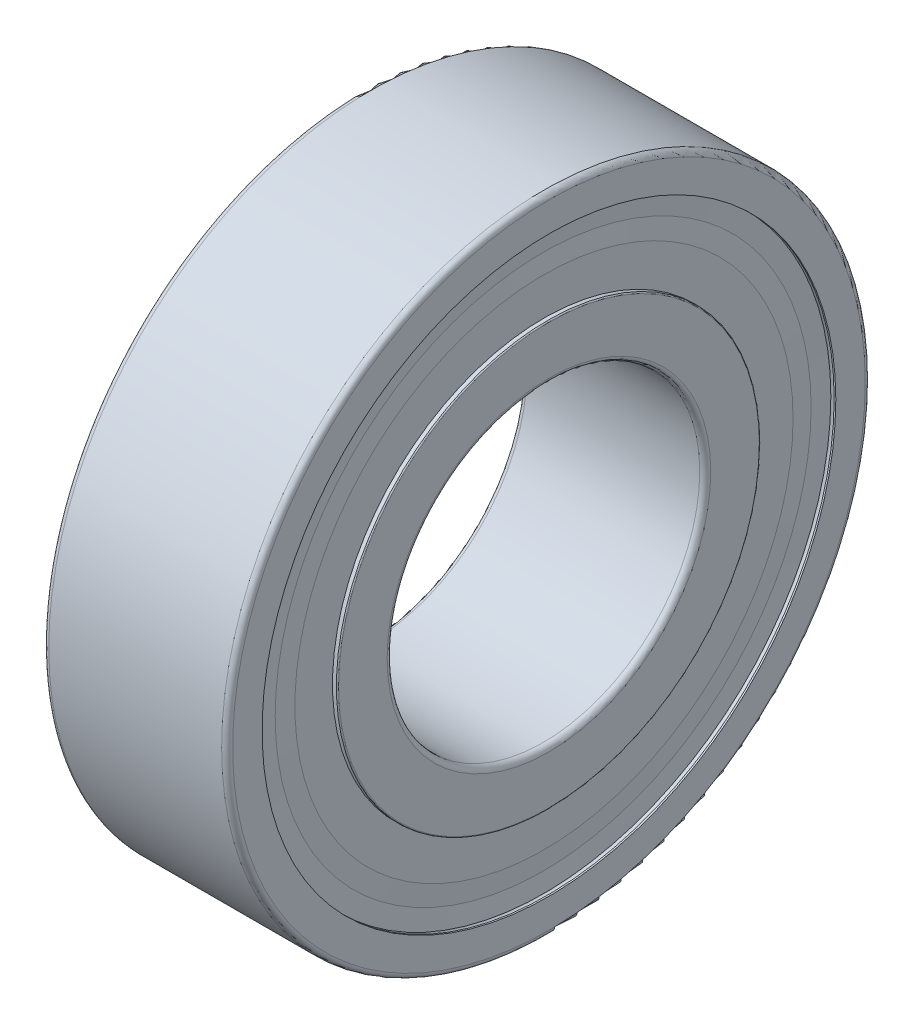
ISO-10303-21;
HEADER;
FILE_DESCRIPTION(('STEP AP214'),'2;1');
FILE_NAME('part.step','',(''),(''),'','','');
FILE_SCHEMA(('AUTOMOTIVE_DESIGN { 1 0 10303 214 1 1 1 1 }'));
ENDSEC;
DATA;
#1=APPLICATION_CONTEXT('core data for automotive mechanical design processes');
#2=APPLICATION_PROTOCOL_DEFINITION('international standard','automotive_design',2000,#1);
#3=PRODUCT_CONTEXT('',#1,'mechanical');
#4=PRODUCT('Part','Part','',(#3));
#5=PRODUCT_RELATED_PRODUCT_CATEGORY('part','',(#4));
#6=PRODUCT_DEFINITION_FORMATION('','',#4);
#7=PRODUCT_DEFINITION_CONTEXT('part definition',#1,'design');
#8=PRODUCT_DEFINITION('design','',#6,#7);
#9=PRODUCT_DEFINITION_SHAPE('','',#8);
#10=(LENGTH_UNIT() NAMED_UNIT(*) SI_UNIT(.MILLI.,.METRE.));
#11=(NAMED_UNIT(*) PLANE_ANGLE_UNIT() SI_UNIT($,.RADIAN.));
#12=(NAMED_UNIT(*) SI_UNIT($,.STERADIAN.) SOLID_ANGLE_UNIT());
#13=UNCERTAINTY_MEASURE_WITH_UNIT(LENGTH_MEASURE(1.E-05),#10,'distance_accuracy_value','');
#14=(GEOMETRIC_REPRESENTATION_CONTEXT(3) GLOBAL_UNCERTAINTY_ASSIGNED_CONTEXT((#13)) GLOBAL_UNIT_ASSIGNED_CONTEXT((#10,
#11,#12)) REPRESENTATION_CONTEXT('',''));
#15=CARTESIAN_POINT('',(0.,0.,0.));
#16=DIRECTION('',(0.,0.,1.));
#17=DIRECTION('',(1.,0.,0.));
#18=AXIS2_PLACEMENT_3D('',#15,#16,#17);
#19=CARTESIAN_POINT('',(50.,0.,0.));
#20=DIRECTION('',(1.,0.,0.));
#21=DIRECTION('',(0.,0.,-1.));
#22=AXIS2_PLACEMENT_3D('',#19,#20,#21);
#23=CYLINDRICAL_SURFACE('',#22,15.6);
#24=CARTESIAN_POINT('',(9.73,0.,0.));
#25=DIRECTION('',(1.,0.,0.));
#26=DIRECTION('',(0.,0.,-1.));
#27=AXIS2_PLACEMENT_3D('',#24,#25,#26);
#28=CIRCLE('',#27,15.6);
#29=CARTESIAN_POINT('',(9.73,0.,-15.6));
#30=VERTEX_POINT('',#29);
#31=EDGE_CURVE('P0_E11',#30,#30,#28,.T.);
#32=ORIENTED_EDGE('',*,*,#31,.F.);
#33=EDGE_LOOP('',(#32));
#34=FACE_BOUND('',#33,.T.);
#35=CARTESIAN_POINT('',(9.64,0.,0.));
#36=DIRECTION('',(1.,0.,0.));
#37=DIRECTION('',(0.,0.,-1.));
#38=AXIS2_PLACEMENT_3D('',#35,#36,#37);
#39=CIRCLE('',#38,15.6);
#40=CARTESIAN_POINT('',(9.64,0.,-15.6));
#41=VERTEX_POINT('',#40);
#42=EDGE_CURVE('P0_E167',#41,#41,#39,.T.);
#43=ORIENTED_EDGE('',*,*,#42,.T.);
#44=EDGE_LOOP('',(#43));
#45=FACE_BOUND('',#44,.T.);
#46=ADVANCED_FACE('P0_F17',(#34,#45),#23,.T.);
#47=CARTESIAN_POINT('',(9.685,0.,0.));
#48=DIRECTION('',(1.,0.,0.));
#49=DIRECTION('',(0.,0.,-1.));
#50=AXIS2_PLACEMENT_3D('',#47,#48,#49);
#51=CONICAL_SURFACE('',#50,14.5725,1.52702867499964);
#52=CARTESIAN_POINT('',(9.685,0.,0.));
#53=DIRECTION('',(1.,0.,0.));
#54=DIRECTION('',(0.,0.,-1.));
#55=AXIS2_PLACEMENT_3D('',#52,#53,#54);
#56=CIRCLE('',#55,14.5725);
#57=CARTESIAN_POINT('',(9.685,0.,-14.5725));
#58=VERTEX_POINT('',#57);
#59=EDGE_CURVE('P0_E27',#58,#58,#56,.T.);
#60=ORIENTED_EDGE('',*,*,#59,.F.);
#61=EDGE_LOOP('',(#60));
#62=FACE_BOUND('',#61,.T.);
#63=ORIENTED_EDGE('',*,*,#31,.T.);
#64=EDGE_LOOP('',(#63));
#65=FACE_BOUND('',#64,.T.);
#66=ADVANCED_FACE('P0_F203',(#62,#65),#51,.F.);
#67=CARTESIAN_POINT('',(9.73,0.,0.));
#68=DIRECTION('',(-1.,0.,0.));
#69=DIRECTION('',(0.,0.,1.));
#70=AXIS2_PLACEMENT_3D('',#67,#68,#69);
#71=CONICAL_SURFACE('',#70,13.545,1.52702867499964);
#72=CARTESIAN_POINT('',(9.73,0.,0.));
#73=DIRECTION('',(1.,0.,0.));
#74=DIRECTION('',(0.,0.,-1.));
#75=AXIS2_PLACEMENT_3D('',#72,#73,#74);
#76=CIRCLE('',#75,13.545);
#77=CARTESIAN_POINT('',(9.73,0.,-13.545));
#78=VERTEX_POINT('',#77);
#79=EDGE_CURVE('P0_E143',#78,#78,#76,.T.);
#80=ORIENTED_EDGE('',*,*,#79,.F.);
#81=EDGE_LOOP('',(#80));
#82=FACE_BOUND('',#81,.T.);
#83=ORIENTED_EDGE('',*,*,#59,.T.);
#84=EDGE_LOOP('',(#83));
#85=FACE_BOUND('',#84,.T.);
#86=ADVANCED_FACE('P0_F200',(#82,#85),#71,.T.);
#87=CARTESIAN_POINT('',(9.73,11.49,0.));
#88=DIRECTION('',(1.,0.,0.));
#89=DIRECTION('',(0.,1.,0.));
#90=AXIS2_PLACEMENT_3D('',#87,#88,#89);
#91=PLANE('',#90);
#92=CARTESIAN_POINT('',(9.73,0.,0.));
#93=DIRECTION('',(-1.,0.,0.));
#94=DIRECTION('',(0.,0.,-1.));
#95=AXIS2_PLACEMENT_3D('',#92,#93,#94);
#96=CIRCLE('',#95,11.5);
#97=CARTESIAN_POINT('',(9.73,0.,-11.5));
#98=VERTEX_POINT('',#97);
#99=EDGE_CURVE('P0_E148',#98,#98,#96,.T.);
#100=ORIENTED_EDGE('',*,*,#99,.T.);
#101=EDGE_LOOP('',(#100));
#102=FACE_BOUND('',#101,.T.);
#103=ORIENTED_EDGE('',*,*,#79,.T.);
#104=EDGE_LOOP('',(#103));
#105=FACE_BOUND('',#104,.T.);
#106=ADVANCED_FACE('P0_F198',(#102,#105),#91,.T.);
#107=CARTESIAN_POINT('',(9.55,0.,0.));
#108=DIRECTION('',(-1.,0.,0.));
#109=DIRECTION('',(0.,0.,1.));
#110=AXIS2_PLACEMENT_3D('',#107,#108,#109);
#111=CONICAL_SURFACE('',#110,13.545,1.52702867499964);
#112=CARTESIAN_POINT('',(9.55,0.,0.));
#113=DIRECTION('',(1.,0.,0.));
#114=DIRECTION('',(0.,0.,-1.));
#115=AXIS2_PLACEMENT_3D('',#112,#113,#114);
#116=CIRCLE('',#115,13.545);
#117=CARTESIAN_POINT('',(9.55,0.,-13.545));
#118=VERTEX_POINT('',#117);
#119=EDGE_CURVE('P0_E170',#118,#118,#116,.T.);
#120=ORIENTED_EDGE('',*,*,#119,.F.);
#121=EDGE_LOOP('',(#120));
#122=FACE_BOUND('',#121,.T.);
#123=CARTESIAN_POINT('',(9.63956204379562,0.,0.));
#124=DIRECTION('',(1.,0.,0.));
#125=DIRECTION('',(0.,0.,1.));
#126=AXIS2_PLACEMENT_3D('',#123,#124,#125);
#127=CIRCLE('',#126,11.5);
#128=CARTESIAN_POINT('',(9.63956204379562,0.,11.5));
#129=VERTEX_POINT('',#128);
#130=EDGE_CURVE('P0_E125',#129,#129,#127,.T.);
#131=ORIENTED_EDGE('',*,*,#130,.T.);
#132=EDGE_LOOP('',(#131));
#133=FACE_BOUND('',#132,.T.);
#134=ADVANCED_FACE('P0_F19',(#122,#133),#111,.F.);
#135=CARTESIAN_POINT('',(9.55,14.5725,0.));
#136=DIRECTION('',(-1.,0.,0.));
#137=DIRECTION('',(0.,0.,1.));
#138=AXIS2_PLACEMENT_3D('',#135,#136,#137);
#139=PLANE('',#138);
#140=CARTESIAN_POINT('',(9.55,0.,0.));
#141=DIRECTION('',(1.,0.,0.));
#142=DIRECTION('',(0.,0.,-1.));
#143=AXIS2_PLACEMENT_3D('',#140,#141,#142);
#144=CIRCLE('',#143,14.5725);
#145=CARTESIAN_POINT('',(9.55,0.,-14.5725));
#146=VERTEX_POINT('',#145);
#147=EDGE_CURVE('P0_E166',#146,#146,#144,.T.);
#148=ORIENTED_EDGE('',*,*,#147,.F.);
#149=EDGE_LOOP('',(#148));
#150=FACE_BOUND('',#149,.T.);
#151=ORIENTED_EDGE('',*,*,#119,.T.);
#152=EDGE_LOOP('',(#151));
#153=FACE_BOUND('',#152,.T.);
#154=ADVANCED_FACE('P0_F244',(#150,#153),#139,.T.);
#155=CARTESIAN_POINT('',(9.64,0.,0.));
#156=DIRECTION('',(1.,0.,0.));
#157=DIRECTION('',(0.,0.,-1.));
#158=AXIS2_PLACEMENT_3D('',#155,#156,#157);
#159=CONICAL_SURFACE('',#158,15.6,1.48342806694239);
#160=ORIENTED_EDGE('',*,*,#42,.F.);
#161=EDGE_LOOP('',(#160));
#162=FACE_BOUND('',#161,.T.);
#163=ORIENTED_EDGE('',*,*,#147,.T.);
#164=EDGE_LOOP('',(#163));
#165=FACE_BOUND('',#164,.T.);
#166=ADVANCED_FACE('P0_F246',(#162,#165),#159,.T.);
#167=CARTESIAN_POINT('',(0.45,0.,0.));
#168=DIRECTION('',(-1.,0.,0.));
#169=DIRECTION('',(0.,0.,1.));
#170=AXIS2_PLACEMENT_3D('',#167,#168,#169);
#171=CONICAL_SURFACE('',#170,14.5725,1.48342806694239);
#172=CARTESIAN_POINT('',(0.45,0.,0.));
#173=DIRECTION('',(1.,0.,0.));
#174=DIRECTION('',(0.,0.,-1.));
#175=AXIS2_PLACEMENT_3D('',#172,#173,#174);
#176=CIRCLE('',#175,14.5725);
#177=CARTESIAN_POINT('',(0.45,0.,-14.5725));
#178=VERTEX_POINT('',#177);
#179=EDGE_CURVE('P0_E163',#178,#178,#176,.T.);
#180=ORIENTED_EDGE('',*,*,#179,.F.);
#181=EDGE_LOOP('',(#180));
#182=FACE_BOUND('',#181,.T.);
#183=CARTESIAN_POINT('',(0.36,0.,0.));
#184=DIRECTION('',(1.,0.,0.));
#185=DIRECTION('',(0.,0.,-1.));
#186=AXIS2_PLACEMENT_3D('',#183,#184,#185);
#187=CIRCLE('',#186,15.6);
#188=CARTESIAN_POINT('',(0.36,0.,-15.6));
#189=VERTEX_POINT('',#188);
#190=EDGE_CURVE('P0_E140',#189,#189,#187,.T.);
#191=ORIENTED_EDGE('',*,*,#190,.T.);
#192=EDGE_LOOP('',(#191));
#193=FACE_BOUND('',#192,.T.);
#194=ADVANCED_FACE('P0_F252',(#182,#193),#171,.T.);
#195=CARTESIAN_POINT('',(0.45,13.545,0.));
#196=DIRECTION('',(1.,0.,0.));
#197=DIRECTION('',(0.,1.,0.));
#198=AXIS2_PLACEMENT_3D('',#195,#196,#197);
#199=PLANE('',#198);
#200=CARTESIAN_POINT('',(0.45,0.,0.));
#201=DIRECTION('',(1.,0.,0.));
#202=DIRECTION('',(0.,0.,-1.));
#203=AXIS2_PLACEMENT_3D('',#200,#201,#202);
#204=CIRCLE('',#203,13.545);
#205=CARTESIAN_POINT('',(0.45,0.,-13.545));
#206=VERTEX_POINT('',#205);
#207=EDGE_CURVE('P0_E156',#206,#206,#204,.T.);
#208=ORIENTED_EDGE('',*,*,#207,.F.);
#209=EDGE_LOOP('',(#208));
#210=FACE_BOUND('',#209,.T.);
#211=ORIENTED_EDGE('',*,*,#179,.T.);
#212=EDGE_LOOP('',(#211));
#213=FACE_BOUND('',#212,.T.);
#214=ADVANCED_FACE('P0_F249',(#210,#213),#199,.T.);
#215=CARTESIAN_POINT('',(0.36,0.,0.));
#216=DIRECTION('',(1.,0.,0.));
#217=DIRECTION('',(0.,0.,-1.));
#218=AXIS2_PLACEMENT_3D('',#215,#216,#217);
#219=CONICAL_SURFACE('',#218,11.49,1.52702867499964);
#220=CARTESIAN_POINT('',(0.360437956204379,0.,0.));
#221=DIRECTION('',(-1.,0.,0.));
#222=DIRECTION('',(0.,0.,-1.));
#223=AXIS2_PLACEMENT_3D('',#220,#221,#222);
#224=CIRCLE('',#223,11.5);
#225=CARTESIAN_POINT('',(0.360437956204379,0.,-11.5));
#226=VERTEX_POINT('',#225);
#227=EDGE_CURVE('P0_E147',#226,#226,#224,.T.);
#228=ORIENTED_EDGE('',*,*,#227,.T.);
#229=EDGE_LOOP('',(#228));
#230=FACE_BOUND('',#229,.T.);
#231=ORIENTED_EDGE('',*,*,#207,.T.);
#232=EDGE_LOOP('',(#231));
#233=FACE_BOUND('',#232,.T.);
#234=ADVANCED_FACE('P0_F231',(#230,#233),#219,.F.);
#235=CARTESIAN_POINT('',(0.27,13.545,0.));
#236=DIRECTION('',(-1.,0.,0.));
#237=DIRECTION('',(0.,0.,1.));
#238=AXIS2_PLACEMENT_3D('',#235,#236,#237);
#239=PLANE('',#238);
#240=CARTESIAN_POINT('',(0.27,0.,0.));
#241=DIRECTION('',(1.,0.,0.));
#242=DIRECTION('',(0.,0.,-1.));
#243=AXIS2_PLACEMENT_3D('',#240,#241,#242);
#244=CIRCLE('',#243,13.545);
#245=CARTESIAN_POINT('',(0.27,0.,-13.545));
#246=VERTEX_POINT('',#245);
#247=EDGE_CURVE('P0_E139',#246,#246,#244,.T.);
#248=ORIENTED_EDGE('',*,*,#247,.F.);
#249=EDGE_LOOP('',(#248));
#250=FACE_BOUND('',#249,.T.);
#251=CARTESIAN_POINT('',(0.27,0.,0.));
#252=DIRECTION('',(1.,0.,0.));
#253=DIRECTION('',(0.,0.,1.));
#254=AXIS2_PLACEMENT_3D('',#251,#252,#253);
#255=CIRCLE('',#254,11.5);
#256=CARTESIAN_POINT('',(0.27,0.,11.5));
#257=VERTEX_POINT('',#256);
#258=EDGE_CURVE('P0_E149',#257,#257,#255,.T.);
#259=ORIENTED_EDGE('',*,*,#258,.T.);
#260=EDGE_LOOP('',(#259));
#261=FACE_BOUND('',#260,.T.);
#262=ADVANCED_FACE('P0_F227',(#250,#261),#239,.T.);
#263=CARTESIAN_POINT('',(0.315,0.,0.));
#264=DIRECTION('',(1.,0.,0.));
#265=DIRECTION('',(0.,0.,-1.));
#266=AXIS2_PLACEMENT_3D('',#263,#264,#265);
#267=CONICAL_SURFACE('',#266,14.5725,1.52702867499964);
#268=CARTESIAN_POINT('',(0.315,0.,0.));
#269=DIRECTION('',(1.,0.,0.));
#270=DIRECTION('',(0.,0.,-1.));
#271=AXIS2_PLACEMENT_3D('',#268,#269,#270);
#272=CIRCLE('',#271,14.5725);
#273=CARTESIAN_POINT('',(0.315,0.,-14.5725));
#274=VERTEX_POINT('',#273);
#275=EDGE_CURVE('P0_E137',#274,#274,#272,.T.);
#276=ORIENTED_EDGE('',*,*,#275,.F.);
#277=EDGE_LOOP('',(#276));
#278=FACE_BOUND('',#277,.T.);
#279=ORIENTED_EDGE('',*,*,#247,.T.);
#280=EDGE_LOOP('',(#279));
#281=FACE_BOUND('',#280,.T.);
#282=ADVANCED_FACE('P0_F230',(#278,#281),#267,.T.);
#283=CARTESIAN_POINT('',(0.27,0.,0.));
#284=DIRECTION('',(-1.,0.,0.));
#285=DIRECTION('',(0.,0.,1.));
#286=AXIS2_PLACEMENT_3D('',#283,#284,#285);
#287=CONICAL_SURFACE('',#286,15.6,1.52702867499964);
#288=CARTESIAN_POINT('',(0.27,0.,0.));
#289=DIRECTION('',(1.,0.,0.));
#290=DIRECTION('',(0.,0.,-1.));
#291=AXIS2_PLACEMENT_3D('',#288,#289,#290);
#292=CIRCLE('',#291,15.6);
#293=CARTESIAN_POINT('',(0.27,0.,-15.6));
#294=VERTEX_POINT('',#293);
#295=EDGE_CURVE('P0_E184',#294,#294,#292,.T.);
#296=ORIENTED_EDGE('',*,*,#295,.F.);
#297=EDGE_LOOP('',(#296));
#298=FACE_BOUND('',#297,.T.);
#299=ORIENTED_EDGE('',*,*,#275,.T.);
#300=EDGE_LOOP('',(#299));
#301=FACE_BOUND('',#300,.T.);
#302=ADVANCED_FACE('P0_F242',(#298,#301),#287,.F.);
#303=CARTESIAN_POINT('',(50.,0.,0.));
#304=DIRECTION('',(1.,0.,0.));
#305=DIRECTION('',(0.,0.,-1.));
#306=AXIS2_PLACEMENT_3D('',#303,#304,#305);
#307=CYLINDRICAL_SURFACE('',#306,15.6);
#308=ORIENTED_EDGE('',*,*,#190,.F.);
#309=EDGE_LOOP('',(#308));
#310=FACE_BOUND('',#309,.T.);
#311=ORIENTED_EDGE('',*,*,#295,.T.);
#312=EDGE_LOOP('',(#311));
#313=FACE_BOUND('',#312,.T.);
#314=ADVANCED_FACE('P0_F271',(#310,#313),#307,.T.);
#315=CARTESIAN_POINT('',(50.,0.,0.));
#316=DIRECTION('',(1.,0.,0.));
#317=DIRECTION('',(0.,0.,-1.));
#318=AXIS2_PLACEMENT_3D('',#315,#316,#317);
#319=CYLINDRICAL_SURFACE('',#318,11.5);
#320=CARTESIAN_POINT('',(3.15090265264373,0.,0.));
#321=DIRECTION('',(1.,0.,0.));
#322=DIRECTION('',(0.,0.,-1.));
#323=AXIS2_PLACEMENT_3D('',#320,#321,#322);
#324=CIRCLE('',#323,11.5);
#325=CARTESIAN_POINT('',(3.15090265264373,0.,-11.5));
#326=VERTEX_POINT('',#325);
#327=EDGE_CURVE('P0_E144',#326,#326,#324,.T.);
#328=ORIENTED_EDGE('',*,*,#327,.F.);
#329=EDGE_LOOP('',(#328));
#330=FACE_BOUND('',#329,.T.);
#331=ORIENTED_EDGE('',*,*,#227,.F.);
#332=EDGE_LOOP('',(#331));
#333=FACE_BOUND('',#332,.T.);
#334=ADVANCED_FACE('P0_F273',(#330,#333),#319,.T.);
#335=CARTESIAN_POINT('',(5.,0.,0.));
#336=DIRECTION('',(1.,0.,0.));
#337=DIRECTION('',(0.,0.,-1.));
#338=AXIS2_PLACEMENT_3D('',#335,#336,#337);
#339=TOROIDAL_SURFACE('',#338,13.,2.381);
#340=ORIENTED_EDGE('',*,*,#327,.T.);
#341=EDGE_LOOP('',(#340));
#342=FACE_BOUND('',#341,.T.);
#343=CARTESIAN_POINT('',(6.84909734735627,0.,0.));
#344=DIRECTION('',(1.,0.,0.));
#345=DIRECTION('',(0.,0.,-1.));
#346=AXIS2_PLACEMENT_3D('',#343,#344,#345);
#347=CIRCLE('',#346,11.5);
#348=CARTESIAN_POINT('',(6.84909734735627,0.,-11.5));
#349=VERTEX_POINT('',#348);
#350=EDGE_CURVE('P0_E121',#349,#349,#347,.T.);
#351=ORIENTED_EDGE('',*,*,#350,.F.);
#352=EDGE_LOOP('',(#351));
#353=FACE_BOUND('',#352,.T.);
#354=ADVANCED_FACE('P0_F269',(#342,#353),#339,.F.);
#355=CARTESIAN_POINT('',(50.,0.,0.));
#356=DIRECTION('',(1.,0.,0.));
#357=DIRECTION('',(0.,0.,-1.));
#358=AXIS2_PLACEMENT_3D('',#355,#356,#357);
#359=CYLINDRICAL_SURFACE('',#358,11.5);
#360=CARTESIAN_POINT('',(9.94,0.,0.));
#361=DIRECTION('',(1.,0.,0.));
#362=DIRECTION('',(0.,0.,-1.));
#363=AXIS2_PLACEMENT_3D('',#360,#361,#362);
#364=CIRCLE('',#363,11.5);
#365=CARTESIAN_POINT('',(9.94,0.,-11.5));
#366=VERTEX_POINT('',#365);
#367=EDGE_CURVE('P0_E174',#366,#366,#364,.T.);
#368=ORIENTED_EDGE('',*,*,#367,.F.);
#369=EDGE_LOOP('',(#368));
#370=FACE_BOUND('',#369,.T.);
#371=ORIENTED_EDGE('',*,*,#99,.F.);
#372=EDGE_LOOP('',(#371));
#373=FACE_BOUND('',#372,.T.);
#374=ADVANCED_FACE('P0_F235',(#370,#373),#359,.T.);
#375=CARTESIAN_POINT('',(9.94,0.,0.));
#376=DIRECTION('',(1.,0.,0.));
#377=DIRECTION('',(0.,0.,-1.));
#378=AXIS2_PLACEMENT_3D('',#375,#376,#377);
#379=TOROIDAL_SURFACE('',#378,11.44,0.0599999999999976);
#380=CARTESIAN_POINT('',(10.,0.,0.));
#381=DIRECTION('',(1.,0.,0.));
#382=DIRECTION('',(0.,0.,-1.));
#383=AXIS2_PLACEMENT_3D('',#380,#381,#382);
#384=CIRCLE('',#383,11.44);
#385=CARTESIAN_POINT('',(10.,0.,-11.44));
#386=VERTEX_POINT('',#385);
#387=EDGE_CURVE('P0_E161',#386,#386,#384,.T.);
#388=ORIENTED_EDGE('',*,*,#387,.F.);
#389=EDGE_LOOP('',(#388));
#390=FACE_BOUND('',#389,.T.);
#391=ORIENTED_EDGE('',*,*,#367,.T.);
#392=EDGE_LOOP('',(#391));
#393=FACE_BOUND('',#392,.T.);
#394=ADVANCED_FACE('P0_F219',(#390,#393),#379,.T.);
#395=CARTESIAN_POINT('',(10.,8.8,0.));
#396=DIRECTION('',(1.,0.,0.));
#397=DIRECTION('',(0.,1.,0.));
#398=AXIS2_PLACEMENT_3D('',#395,#396,#397);
#399=PLANE('',#398);
#400=CARTESIAN_POINT('',(10.,0.,0.));
#401=DIRECTION('',(1.,0.,0.));
#402=DIRECTION('',(0.,0.,-1.));
#403=AXIS2_PLACEMENT_3D('',#400,#401,#402);
#404=CIRCLE('',#403,8.8);
#405=CARTESIAN_POINT('',(10.,0.,-8.8));
#406=VERTEX_POINT('',#405);
#407=EDGE_CURVE('P0_E157',#406,#406,#404,.T.);
#408=ORIENTED_EDGE('',*,*,#407,.F.);
#409=EDGE_LOOP('',(#408));
#410=FACE_BOUND('',#409,.T.);
#411=ORIENTED_EDGE('',*,*,#387,.T.);
#412=EDGE_LOOP('',(#411));
#413=FACE_BOUND('',#412,.T.);
#414=ADVANCED_FACE('P0_F215',(#410,#413),#399,.T.);
#415=CARTESIAN_POINT('',(9.7,0.,0.));
#416=DIRECTION('',(1.,0.,0.));
#417=DIRECTION('',(0.,0.,-1.));
#418=AXIS2_PLACEMENT_3D('',#415,#416,#417);
#419=TOROIDAL_SURFACE('',#418,8.8,0.300000000000005);
#420=CARTESIAN_POINT('',(9.7,0.,0.));
#421=DIRECTION('',(1.,0.,0.));
#422=DIRECTION('',(0.,0.,-1.));
#423=AXIS2_PLACEMENT_3D('',#420,#421,#422);
#424=CIRCLE('',#423,8.5);
#425=CARTESIAN_POINT('',(9.7,0.,-8.5));
#426=VERTEX_POINT('',#425);
#427=EDGE_CURVE('P0_E162',#426,#426,#424,.T.);
#428=ORIENTED_EDGE('',*,*,#427,.F.);
#429=EDGE_LOOP('',(#428));
#430=FACE_BOUND('',#429,.T.);
#431=ORIENTED_EDGE('',*,*,#407,.T.);
#432=EDGE_LOOP('',(#431));
#433=FACE_BOUND('',#432,.T.);
#434=ADVANCED_FACE('P0_F218',(#430,#433),#419,.T.);
#435=CARTESIAN_POINT('',(50.,0.,0.));
#436=DIRECTION('',(1.,0.,0.));
#437=DIRECTION('',(0.,0.,-1.));
#438=AXIS2_PLACEMENT_3D('',#435,#436,#437);
#439=CYLINDRICAL_SURFACE('',#438,8.5);
#440=CARTESIAN_POINT('',(0.3,0.,0.));
#441=DIRECTION('',(1.,0.,0.));
#442=DIRECTION('',(0.,0.,-1.));
#443=AXIS2_PLACEMENT_3D('',#440,#441,#442);
#444=CIRCLE('',#443,8.5);
#445=CARTESIAN_POINT('',(0.3,0.,-8.5));
#446=VERTEX_POINT('',#445);
#447=EDGE_CURVE('P0_E183',#446,#446,#444,.T.);
#448=ORIENTED_EDGE('',*,*,#447,.F.);
#449=EDGE_LOOP('',(#448));
#450=FACE_BOUND('',#449,.T.);
#451=ORIENTED_EDGE('',*,*,#427,.T.);
#452=EDGE_LOOP('',(#451));
#453=FACE_BOUND('',#452,.T.);
#454=ADVANCED_FACE('P0_F225',(#450,#453),#439,.F.);
#455=CARTESIAN_POINT('',(0.3,0.,0.));
#456=DIRECTION('',(1.,0.,0.));
#457=DIRECTION('',(0.,0.,-1.));
#458=AXIS2_PLACEMENT_3D('',#455,#456,#457);
#459=TOROIDAL_SURFACE('',#458,8.8,0.3);
#460=CARTESIAN_POINT('',(0.,0.,0.));
#461=DIRECTION('',(1.,0.,0.));
#462=DIRECTION('',(0.,0.,-1.));
#463=AXIS2_PLACEMENT_3D('',#460,#461,#462);
#464=CIRCLE('',#463,8.8);
#465=CARTESIAN_POINT('',(0.,0.,-8.8));
#466=VERTEX_POINT('',#465);
#467=EDGE_CURVE('P0_E190',#466,#466,#464,.T.);
#468=ORIENTED_EDGE('',*,*,#467,.F.);
#469=EDGE_LOOP('',(#468));
#470=FACE_BOUND('',#469,.T.);
#471=ORIENTED_EDGE('',*,*,#447,.T.);
#472=EDGE_LOOP('',(#471));
#473=FACE_BOUND('',#472,.T.);
#474=ADVANCED_FACE('P0_F221',(#470,#473),#459,.T.);
#475=CARTESIAN_POINT('',(0.,11.44,0.));
#476=DIRECTION('',(-1.,0.,0.));
#477=DIRECTION('',(0.,0.,1.));
#478=AXIS2_PLACEMENT_3D('',#475,#476,#477);
#479=PLANE('',#478);
#480=CARTESIAN_POINT('',(0.,0.,0.));
#481=DIRECTION('',(1.,0.,0.));
#482=DIRECTION('',(0.,0.,-1.));
#483=AXIS2_PLACEMENT_3D('',#480,#481,#482);
#484=CIRCLE('',#483,11.44);
#485=CARTESIAN_POINT('',(0.,0.,-11.44));
#486=VERTEX_POINT('',#485);
#487=EDGE_CURVE('P0_E135',#486,#486,#484,.T.);
#488=ORIENTED_EDGE('',*,*,#487,.F.);
#489=EDGE_LOOP('',(#488));
#490=FACE_BOUND('',#489,.T.);
#491=ORIENTED_EDGE('',*,*,#467,.T.);
#492=EDGE_LOOP('',(#491));
#493=FACE_BOUND('',#492,.T.);
#494=ADVANCED_FACE('P0_F224',(#490,#493),#479,.T.);
#495=CARTESIAN_POINT('',(0.0599999999999987,0.,0.));
#496=DIRECTION('',(1.,0.,0.));
#497=DIRECTION('',(0.,0.,-1.));
#498=AXIS2_PLACEMENT_3D('',#495,#496,#497);
#499=TOROIDAL_SURFACE('',#498,11.44,0.0599999999999993);
#500=CARTESIAN_POINT('',(0.0599999999999976,0.,0.));
#501=DIRECTION('',(1.,0.,0.));
#502=DIRECTION('',(0.,0.,-1.));
#503=AXIS2_PLACEMENT_3D('',#500,#501,#502);
#504=CIRCLE('',#503,11.5);
#505=CARTESIAN_POINT('',(0.0599999999999976,0.,-11.5));
#506=VERTEX_POINT('',#505);
#507=EDGE_CURVE('P0_E131',#506,#506,#504,.T.);
#508=ORIENTED_EDGE('',*,*,#507,.F.);
#509=EDGE_LOOP('',(#508));
#510=FACE_BOUND('',#509,.T.);
#511=ORIENTED_EDGE('',*,*,#487,.T.);
#512=EDGE_LOOP('',(#511));
#513=FACE_BOUND('',#512,.T.);
#514=ADVANCED_FACE('P0_F276',(#510,#513),#499,.T.);
#515=CARTESIAN_POINT('',(50.,0.,0.));
#516=DIRECTION('',(1.,0.,0.));
#517=DIRECTION('',(0.,0.,-1.));
#518=AXIS2_PLACEMENT_3D('',#515,#516,#517);
#519=CYLINDRICAL_SURFACE('',#518,11.5);
#520=ORIENTED_EDGE('',*,*,#258,.F.);
#521=EDGE_LOOP('',(#520));
#522=FACE_BOUND('',#521,.T.);
#523=ORIENTED_EDGE('',*,*,#507,.T.);
#524=EDGE_LOOP('',(#523));
#525=FACE_BOUND('',#524,.T.);
#526=ADVANCED_FACE('P0_F262',(#522,#525),#519,.T.);
#527=CARTESIAN_POINT('',(50.,0.,0.));
#528=DIRECTION('',(1.,0.,0.));
#529=DIRECTION('',(0.,0.,-1.));
#530=AXIS2_PLACEMENT_3D('',#527,#528,#529);
#531=CYLINDRICAL_SURFACE('',#530,11.5);
#532=ORIENTED_EDGE('',*,*,#130,.F.);
#533=EDGE_LOOP('',(#532));
#534=FACE_BOUND('',#533,.T.);
#535=ORIENTED_EDGE('',*,*,#350,.T.);
#536=EDGE_LOOP('',(#535));
#537=FACE_BOUND('',#536,.T.);
#538=ADVANCED_FACE('P0_F122',(#534,#537),#531,.T.);
#539=CLOSED_SHELL('',(#46,#66,#86,#106,#134,#154,#166,#194,#214,#234,#262,#282,#302,#314,#334,
#354,#374,#394,#414,#434,#454,#474,#494,#514,#526,#538));
#540=MANIFOLD_SOLID_BREP('P0_B1',#539);
#541=CARTESIAN_POINT('',(50.,0.,0.));
#542=DIRECTION('',(1.,0.,0.));
#543=DIRECTION('',(0.,0.,-1.));
#544=AXIS2_PLACEMENT_3D('',#541,#542,#543);
#545=CYLINDRICAL_SURFACE('',#544,17.5);
#546=CARTESIAN_POINT('',(9.7,0.,0.));
#547=DIRECTION('',(1.,0.,0.));
#548=DIRECTION('',(0.,0.,-1.));
#549=AXIS2_PLACEMENT_3D('',#546,#547,#548);
#550=CIRCLE('',#549,17.5);
#551=CARTESIAN_POINT('',(9.7,0.,-17.5));
#552=VERTEX_POINT('',#551);
#553=EDGE_CURVE('P1_E12',#552,#552,#550,.T.);
#554=ORIENTED_EDGE('',*,*,#553,.F.);
#555=EDGE_LOOP('',(#554));
#556=FACE_BOUND('',#555,.T.);
#557=CARTESIAN_POINT('',(0.3,0.,0.));
#558=DIRECTION('',(1.,0.,0.));
#559=DIRECTION('',(0.,0.,-1.));
#560=AXIS2_PLACEMENT_3D('',#557,#558,#559);
#561=CIRCLE('',#560,17.5);
#562=CARTESIAN_POINT('',(0.3,0.,-17.5));
#563=VERTEX_POINT('',#562);
#564=EDGE_CURVE('P1_E105',#563,#563,#561,.T.);
#565=ORIENTED_EDGE('',*,*,#564,.T.);
#566=EDGE_LOOP('',(#565));
#567=FACE_BOUND('',#566,.T.);
#568=ADVANCED_FACE('P1_F19',(#556,#567),#545,.T.);
#569=CARTESIAN_POINT('',(9.7,0.,0.));
#570=DIRECTION('',(1.,0.,0.));
#571=DIRECTION('',(0.,0.,-1.));
#572=AXIS2_PLACEMENT_3D('',#569,#570,#571);
#573=TOROIDAL_SURFACE('',#572,17.2,0.3);
#574=CARTESIAN_POINT('',(10.,0.,0.));
#575=DIRECTION('',(1.,0.,0.));
#576=DIRECTION('',(0.,0.,-1.));
#577=AXIS2_PLACEMENT_3D('',#574,#575,#576);
#578=CIRCLE('',#577,17.2);
#579=CARTESIAN_POINT('',(10.,0.,-17.2));
#580=VERTEX_POINT('',#579);
#581=EDGE_CURVE('P1_E30',#580,#580,#578,.T.);
#582=ORIENTED_EDGE('',*,*,#581,.F.);
#583=EDGE_LOOP('',(#582));
#584=FACE_BOUND('',#583,.T.);
#585=ORIENTED_EDGE('',*,*,#553,.T.);
#586=EDGE_LOOP('',(#585));
#587=FACE_BOUND('',#586,.T.);
#588=ADVANCED_FACE('P1_F21',(#584,#587),#573,.T.);
#589=CARTESIAN_POINT('',(10.,15.6,0.));
#590=DIRECTION('',(1.,0.,0.));
#591=DIRECTION('',(0.,1.,0.));
#592=AXIS2_PLACEMENT_3D('',#589,#590,#591);
#593=PLANE('',#592);
#594=CARTESIAN_POINT('',(10.,0.,0.));
#595=DIRECTION('',(1.,0.,0.));
#596=DIRECTION('',(0.,0.,-1.));
#597=AXIS2_PLACEMENT_3D('',#594,#595,#596);
#598=CIRCLE('',#597,15.6);
#599=CARTESIAN_POINT('',(10.,0.,-15.6));
#600=VERTEX_POINT('',#599);
#601=EDGE_CURVE('P1_E89',#600,#600,#598,.T.);
#602=ORIENTED_EDGE('',*,*,#601,.F.);
#603=EDGE_LOOP('',(#602));
#604=FACE_BOUND('',#603,.T.);
#605=ORIENTED_EDGE('',*,*,#581,.T.);
#606=EDGE_LOOP('',(#605));
#607=FACE_BOUND('',#606,.T.);
#608=ADVANCED_FACE('P1_F154',(#604,#607),#593,.T.);
#609=CARTESIAN_POINT('',(50.,0.,0.));
#610=DIRECTION('',(1.,0.,0.));
#611=DIRECTION('',(0.,0.,-1.));
#612=AXIS2_PLACEMENT_3D('',#609,#610,#611);
#613=CYLINDRICAL_SURFACE('',#612,15.6);
#614=CARTESIAN_POINT('',(9.91,0.,0.));
#615=DIRECTION('',(1.,0.,0.));
#616=DIRECTION('',(0.,0.,-1.));
#617=AXIS2_PLACEMENT_3D('',#614,#615,#616);
#618=CIRCLE('',#617,15.6);
#619=CARTESIAN_POINT('',(9.91,0.,-15.6));
#620=VERTEX_POINT('',#619);
#621=EDGE_CURVE('P1_E93',#620,#620,#618,.T.);
#622=ORIENTED_EDGE('',*,*,#621,.F.);
#623=EDGE_LOOP('',(#622));
#624=FACE_BOUND('',#623,.T.);
#625=ORIENTED_EDGE('',*,*,#601,.T.);
#626=EDGE_LOOP('',(#625));
#627=FACE_BOUND('',#626,.T.);
#628=ADVANCED_FACE('P1_F90',(#624,#627),#613,.F.);
#629=CARTESIAN_POINT('',(9.73,0.,0.));
#630=DIRECTION('',(1.,0.,0.));
#631=DIRECTION('',(0.,0.,-1.));
#632=AXIS2_PLACEMENT_3D('',#629,#630,#631);
#633=TOROIDAL_SURFACE('',#632,15.6000000094977,0.18);
#634=ORIENTED_EDGE('',*,*,#621,.T.);
#635=EDGE_LOOP('',(#634));
#636=FACE_BOUND('',#635,.T.);
#637=CARTESIAN_POINT('',(9.55,0.,0.));
#638=DIRECTION('',(1.,0.,0.));
#639=DIRECTION('',(0.,0.,-1.));
#640=AXIS2_PLACEMENT_3D('',#637,#638,#639);
#641=CIRCLE('',#640,15.6);
#642=CARTESIAN_POINT('',(9.55,0.,-15.6));
#643=VERTEX_POINT('',#642);
#644=EDGE_CURVE('P1_E101',#643,#643,#641,.T.);
#645=ORIENTED_EDGE('',*,*,#644,.F.);
#646=EDGE_LOOP('',(#645));
#647=FACE_BOUND('',#646,.T.);
#648=ADVANCED_FACE('P1_F157',(#636,#647),#633,.F.);
#649=CARTESIAN_POINT('',(9.37367301929154,0.,0.));
#650=DIRECTION('',(1.,0.,0.));
#651=DIRECTION('',(0.,0.,-1.));
#652=AXIS2_PLACEMENT_3D('',#649,#650,#651);
#653=CONICAL_SURFACE('',#652,14.6,1.39626340159546);
#654=CARTESIAN_POINT('',(9.37367301929154,0.,0.));
#655=DIRECTION('',(1.,0.,0.));
#656=DIRECTION('',(0.,0.,-1.));
#657=AXIS2_PLACEMENT_3D('',#654,#655,#656);
#658=CIRCLE('',#657,14.6);
#659=CARTESIAN_POINT('',(9.37367301929154,0.,-14.6));
#660=VERTEX_POINT('',#659);
#661=EDGE_CURVE('P1_E23',#660,#660,#658,.T.);
#662=ORIENTED_EDGE('',*,*,#661,.F.);
#663=EDGE_LOOP('',(#662));
#664=FACE_BOUND('',#663,.T.);
#665=ORIENTED_EDGE('',*,*,#644,.T.);
#666=EDGE_LOOP('',(#665));
#667=FACE_BOUND('',#666,.T.);
#668=ADVANCED_FACE('P1_F160',(#664,#667),#653,.F.);
#669=CARTESIAN_POINT('',(50.,0.,0.));
#670=DIRECTION('',(1.,0.,0.));
#671=DIRECTION('',(0.,0.,-1.));
#672=AXIS2_PLACEMENT_3D('',#669,#670,#671);
#673=CYLINDRICAL_SURFACE('',#672,14.6);
#674=CARTESIAN_POINT('',(6.76328131618299,0.,0.));
#675=DIRECTION('',(1.,0.,0.));
#676=DIRECTION('',(0.,0.,-1.));
#677=AXIS2_PLACEMENT_3D('',#674,#675,#676);
#678=CIRCLE('',#677,14.6);
#679=CARTESIAN_POINT('',(6.76328131618299,0.,-14.6));
#680=VERTEX_POINT('',#679);
#681=EDGE_CURVE('P1_E121',#680,#680,#678,.T.);
#682=ORIENTED_EDGE('',*,*,#681,.F.);
#683=EDGE_LOOP('',(#682));
#684=FACE_BOUND('',#683,.T.);
#685=ORIENTED_EDGE('',*,*,#661,.T.);
#686=EDGE_LOOP('',(#685));
#687=FACE_BOUND('',#686,.T.);
#688=ADVANCED_FACE('P1_F168',(#684,#687),#673,.F.);
#689=CARTESIAN_POINT('',(5.,0.,0.));
#690=DIRECTION('',(1.,0.,0.));
#691=DIRECTION('',(0.,0.,-1.));
#692=AXIS2_PLACEMENT_3D('',#689,#690,#691);
#693=TOROIDAL_SURFACE('',#692,13.,2.381);
#694=ORIENTED_EDGE('',*,*,#681,.T.);
#695=EDGE_LOOP('',(#694));
#696=FACE_BOUND('',#695,.T.);
#697=CARTESIAN_POINT('',(3.23671868381702,0.,0.));
#698=DIRECTION('',(1.,0.,0.));
#699=DIRECTION('',(0.,0.,-1.));
#700=AXIS2_PLACEMENT_3D('',#697,#698,#699);
#701=CIRCLE('',#700,14.6);
#702=CARTESIAN_POINT('',(3.23671868381702,0.,-14.6));
#703=VERTEX_POINT('',#702);
#704=EDGE_CURVE('P1_E118',#703,#703,#701,.T.);
#705=ORIENTED_EDGE('',*,*,#704,.F.);
#706=EDGE_LOOP('',(#705));
#707=FACE_BOUND('',#706,.T.);
#708=ADVANCED_FACE('P1_F180',(#696,#707),#693,.F.);
#709=CARTESIAN_POINT('',(50.,0.,0.));
#710=DIRECTION('',(1.,0.,0.));
#711=DIRECTION('',(0.,0.,-1.));
#712=AXIS2_PLACEMENT_3D('',#709,#710,#711);
#713=CYLINDRICAL_SURFACE('',#712,14.6);
#714=CARTESIAN_POINT('',(0.626326980708462,0.,0.));
#715=DIRECTION('',(1.,0.,0.));
#716=DIRECTION('',(0.,0.,-1.));
#717=AXIS2_PLACEMENT_3D('',#714,#715,#716);
#718=CIRCLE('',#717,14.6);
#719=CARTESIAN_POINT('',(0.626326980708462,0.,-14.6));
#720=VERTEX_POINT('',#719);
#721=EDGE_CURVE('P1_E114',#720,#720,#718,.T.);
#722=ORIENTED_EDGE('',*,*,#721,.F.);
#723=EDGE_LOOP('',(#722));
#724=FACE_BOUND('',#723,.T.);
#725=ORIENTED_EDGE('',*,*,#704,.T.);
#726=EDGE_LOOP('',(#725));
#727=FACE_BOUND('',#726,.T.);
#728=ADVANCED_FACE('P1_F177',(#724,#727),#713,.F.);
#729=CARTESIAN_POINT('',(0.45,0.,0.));
#730=DIRECTION('',(-1.,0.,0.));
#731=DIRECTION('',(0.,0.,1.));
#732=AXIS2_PLACEMENT_3D('',#729,#730,#731);
#733=CONICAL_SURFACE('',#732,15.6,1.39626340159546);
#734=CARTESIAN_POINT('',(0.45,0.,0.));
#735=DIRECTION('',(1.,0.,0.));
#736=DIRECTION('',(0.,0.,-1.));
#737=AXIS2_PLACEMENT_3D('',#734,#735,#736);
#738=CIRCLE('',#737,15.6);
#739=CARTESIAN_POINT('',(0.45,0.,-15.6));
#740=VERTEX_POINT('',#739);
#741=EDGE_CURVE('P1_E111',#740,#740,#738,.T.);
#742=ORIENTED_EDGE('',*,*,#741,.F.);
#743=EDGE_LOOP('',(#742));
#744=FACE_BOUND('',#743,.T.);
#745=ORIENTED_EDGE('',*,*,#721,.T.);
#746=EDGE_LOOP('',(#745));
#747=FACE_BOUND('',#746,.T.);
#748=ADVANCED_FACE('P1_F171',(#744,#747),#733,.F.);
#749=CARTESIAN_POINT('',(0.27,0.,0.));
#750=DIRECTION('',(1.,0.,0.));
#751=DIRECTION('',(0.,0.,-1.));
#752=AXIS2_PLACEMENT_3D('',#749,#750,#751);
#753=TOROIDAL_SURFACE('',#752,15.6,0.18);
#754=ORIENTED_EDGE('',*,*,#741,.T.);
#755=EDGE_LOOP('',(#754));
#756=FACE_BOUND('',#755,.T.);
#757=CARTESIAN_POINT('',(0.09,0.,0.));
#758=DIRECTION('',(1.,0.,0.));
#759=DIRECTION('',(0.,0.,-1.));
#760=AXIS2_PLACEMENT_3D('',#757,#758,#759);
#761=CIRCLE('',#760,15.6);
#762=CARTESIAN_POINT('',(0.09,0.,-15.6));
#763=VERTEX_POINT('',#762);
#764=EDGE_CURVE('P1_E108',#763,#763,#761,.T.);
#765=ORIENTED_EDGE('',*,*,#764,.F.);
#766=EDGE_LOOP('',(#765));
#767=FACE_BOUND('',#766,.T.);
#768=ADVANCED_FACE('P1_F164',(#756,#767),#753,.F.);
#769=CARTESIAN_POINT('',(50.,0.,0.));
#770=DIRECTION('',(1.,0.,0.));
#771=DIRECTION('',(0.,0.,-1.));
#772=AXIS2_PLACEMENT_3D('',#769,#770,#771);
#773=CYLINDRICAL_SURFACE('',#772,15.6);
#774=CARTESIAN_POINT('',(0.,0.,0.));
#775=DIRECTION('',(1.,0.,0.));
#776=DIRECTION('',(0.,0.,-1.));
#777=AXIS2_PLACEMENT_3D('',#774,#775,#776);
#778=CIRCLE('',#777,15.6);
#779=CARTESIAN_POINT('',(0.,0.,-15.6));
#780=VERTEX_POINT('',#779);
#781=EDGE_CURVE('P1_E107',#780,#780,#778,.T.);
#782=ORIENTED_EDGE('',*,*,#781,.F.);
#783=EDGE_LOOP('',(#782));
#784=FACE_BOUND('',#783,.T.);
#785=ORIENTED_EDGE('',*,*,#764,.T.);
#786=EDGE_LOOP('',(#785));
#787=FACE_BOUND('',#786,.T.);
#788=ADVANCED_FACE('P1_F144',(#784,#787),#773,.F.);
#789=CARTESIAN_POINT('',(0.,17.2,0.));
#790=DIRECTION('',(-1.,0.,0.));
#791=DIRECTION('',(0.,0.,1.));
#792=AXIS2_PLACEMENT_3D('',#789,#790,#791);
#793=PLANE('',#792);
#794=CARTESIAN_POINT('',(0.,0.,0.));
#795=DIRECTION('',(1.,0.,0.));
#796=DIRECTION('',(0.,0.,-1.));
#797=AXIS2_PLACEMENT_3D('',#794,#795,#796);
#798=CIRCLE('',#797,17.2);
#799=CARTESIAN_POINT('',(0.,0.,-17.2));
#800=VERTEX_POINT('',#799);
#801=EDGE_CURVE('P1_E125',#800,#800,#798,.T.);
#802=ORIENTED_EDGE('',*,*,#801,.F.);
#803=EDGE_LOOP('',(#802));
#804=FACE_BOUND('',#803,.T.);
#805=ORIENTED_EDGE('',*,*,#781,.T.);
#806=EDGE_LOOP('',(#805));
#807=FACE_BOUND('',#806,.T.);
#808=ADVANCED_FACE('P1_F138',(#804,#807),#793,.T.);
#809=CARTESIAN_POINT('',(0.3,0.,0.));
#810=DIRECTION('',(1.,0.,0.));
#811=DIRECTION('',(0.,0.,-1.));
#812=AXIS2_PLACEMENT_3D('',#809,#810,#811);
#813=TOROIDAL_SURFACE('',#812,17.2,0.3);
#814=ORIENTED_EDGE('',*,*,#564,.F.);
#815=EDGE_LOOP('',(#814));
#816=FACE_BOUND('',#815,.T.);
#817=ORIENTED_EDGE('',*,*,#801,.T.);
#818=EDGE_LOOP('',(#817));
#819=FACE_BOUND('',#818,.T.);
#820=ADVANCED_FACE('P1_F136',(#816,#819),#813,.T.);
#821=CLOSED_SHELL('',(#568,#588,#608,#628,#648,#668,#688,#708,#728,#748,#768,#788,#808,#820));
#822=MANIFOLD_SOLID_BREP('P1_B1',#821);
#823=CARTESIAN_POINT('',(5.,10.5172209268743,7.64120827980215));
#824=DIRECTION('',(1.,0.,0.));
#825=DIRECTION('',(0.,-0.809016994374947,-0.587785252292473));
#826=AXIS2_PLACEMENT_3D('',#823,#824,#825);
#827=SPHERICAL_SURFACE('',#826,2.381);
#828=CARTESIAN_POINT('',(2.619,10.5172209268743,7.64120827980215));
#829=VERTEX_POINT('',#828);
#830=VERTEX_LOOP('',#829);
#831=FACE_BOUND('',#830,.T.);
#832=ADVANCED_FACE('P2_F15',(#831),#827,.T.);
#833=CLOSED_SHELL('',(#832));
#834=MANIFOLD_SOLID_BREP('P2_B1',#833);
#835=CARTESIAN_POINT('',(5.,13.,0.));
#836=DIRECTION('',(1.,0.,0.));
#837=DIRECTION('',(0.,-1.,0.));
#838=AXIS2_PLACEMENT_3D('',#835,#836,#837);
#839=SPHERICAL_SURFACE('',#838,2.381);
#840=CARTESIAN_POINT('',(2.619,13.,0.));
#841=VERTEX_POINT('',#840);
#842=VERTEX_LOOP('',#841);
#843=FACE_BOUND('',#842,.T.);
#844=ADVANCED_FACE('P3_F15',(#843),#839,.T.);
#845=CLOSED_SHELL('',(#844));
#846=MANIFOLD_SOLID_BREP('P3_B1',#845);
#847=CARTESIAN_POINT('',(5.,4.01722092687431,12.363734711837));
#848=DIRECTION('',(1.,0.,0.));
#849=DIRECTION('',(0.,-0.309016994374947,-0.951056516295154));
#850=AXIS2_PLACEMENT_3D('',#847,#848,#849);
#851=SPHERICAL_SURFACE('',#850,2.381);
#852=CARTESIAN_POINT('',(2.619,4.01722092687431,12.363734711837));
#853=VERTEX_POINT('',#852);
#854=VERTEX_LOOP('',#853);
#855=FACE_BOUND('',#854,.T.);
#856=ADVANCED_FACE('P4_F15',(#855),#851,.T.);
#857=CLOSED_SHELL('',(#856));
#858=MANIFOLD_SOLID_BREP('P4_B1',#857);
#859=CARTESIAN_POINT('',(5.,-4.01722092687432,12.363734711837));
#860=DIRECTION('',(1.,0.,0.));
#861=DIRECTION('',(0.,0.309016994374948,-0.951056516295153));
#862=AXIS2_PLACEMENT_3D('',#859,#860,#861);
#863=SPHERICAL_SURFACE('',#862,2.381);
#864=CARTESIAN_POINT('',(2.619,-4.01722092687432,12.363734711837));
#865=VERTEX_POINT('',#864);
#866=VERTEX_LOOP('',#865);
#867=FACE_BOUND('',#866,.T.);
#868=ADVANCED_FACE('P5_F15',(#867),#863,.T.);
#869=CLOSED_SHELL('',(#868));
#870=MANIFOLD_SOLID_BREP('P5_B1',#869);
#871=CARTESIAN_POINT('',(5.,-10.5172209268743,7.64120827980215));
#872=DIRECTION('',(1.,0.,0.));
#873=DIRECTION('',(0.,0.809016994374948,-0.587785252292473));
#874=AXIS2_PLACEMENT_3D('',#871,#872,#873);
#875=SPHERICAL_SURFACE('',#874,2.381);
#876=CARTESIAN_POINT('',(2.619,-10.5172209268743,7.64120827980215));
#877=VERTEX_POINT('',#876);
#878=VERTEX_LOOP('',#877);
#879=FACE_BOUND('',#878,.T.);
#880=ADVANCED_FACE('P6_F15',(#879),#875,.T.);
#881=CLOSED_SHELL('',(#880));
#882=MANIFOLD_SOLID_BREP('P6_B1',#881);
#883=CARTESIAN_POINT('',(5.,-13.,0.));
#884=DIRECTION('',(1.,0.,0.));
#885=DIRECTION('',(0.,1.,0.));
#886=AXIS2_PLACEMENT_3D('',#883,#884,#885);
#887=SPHERICAL_SURFACE('',#886,2.381);
#888=CARTESIAN_POINT('',(2.619,-13.,0.));
#889=VERTEX_POINT('',#888);
#890=VERTEX_LOOP('',#889);
#891=FACE_BOUND('',#890,.T.);
#892=ADVANCED_FACE('P7_F15',(#891),#887,.T.);
#893=CLOSED_SHELL('',(#892));
#894=MANIFOLD_SOLID_BREP('P7_B1',#893);
#895=CARTESIAN_POINT('',(5.,-10.5172209268743,-7.64120827980215));
#896=DIRECTION('',(1.,0.,0.));
#897=DIRECTION('',(0.,0.809016994374947,0.587785252292473));
#898=AXIS2_PLACEMENT_3D('',#895,#896,#897);
#899=SPHERICAL_SURFACE('',#898,2.381);
#900=CARTESIAN_POINT('',(2.619,-10.5172209268743,-7.64120827980215));
#901=VERTEX_POINT('',#900);
#902=VERTEX_LOOP('',#901);
#903=FACE_BOUND('',#902,.T.);
#904=ADVANCED_FACE('P8_F15',(#903),#899,.T.);
#905=CLOSED_SHELL('',(#904));
#906=MANIFOLD_SOLID_BREP('P8_B1',#905);
#907=CARTESIAN_POINT('',(5.,-4.01722092687431,-12.363734711837));
#908=DIRECTION('',(1.,0.,0.));
#909=DIRECTION('',(0.,0.309016994374947,0.951056516295154));
#910=AXIS2_PLACEMENT_3D('',#907,#908,#909);
#911=SPHERICAL_SURFACE('',#910,2.381);
#912=CARTESIAN_POINT('',(2.619,-4.01722092687431,-12.363734711837));
#913=VERTEX_POINT('',#912);
#914=VERTEX_LOOP('',#913);
#915=FACE_BOUND('',#914,.T.);
#916=ADVANCED_FACE('P9_F15',(#915),#911,.T.);
#917=CLOSED_SHELL('',(#916));
#918=MANIFOLD_SOLID_BREP('P9_B1',#917);
#919=CARTESIAN_POINT('',(5.,4.01722092687432,-12.363734711837));
#920=DIRECTION('',(1.,0.,0.));
#921=DIRECTION('',(0.,-0.309016994374948,0.951056516295153));
#922=AXIS2_PLACEMENT_3D('',#919,#920,#921);
#923=SPHERICAL_SURFACE('',#922,2.381);
#924=CARTESIAN_POINT('',(2.619,4.01722092687432,-12.363734711837));
#925=VERTEX_POINT('',#924);
#926=VERTEX_LOOP('',#925);
#927=FACE_BOUND('',#926,.T.);
#928=ADVANCED_FACE('P10_F15',(#927),#923,.T.);
#929=CLOSED_SHELL('',(#928));
#930=MANIFOLD_SOLID_BREP('P10_B1',#929);
#931=CARTESIAN_POINT('',(5.,10.5172209268743,-7.64120827980215));
#932=DIRECTION('',(1.,0.,0.));
#933=DIRECTION('',(0.,-0.809016994374947,0.587785252292473));
#934=AXIS2_PLACEMENT_3D('',#931,#932,#933);
#935=SPHERICAL_SURFACE('',#934,2.381);
#936=CARTESIAN_POINT('',(2.619,10.5172209268743,-7.64120827980215));
#937=VERTEX_POINT('',#936);
#938=VERTEX_LOOP('',#937);
#939=FACE_BOUND('',#938,.T.);
#940=ADVANCED_FACE('P11_F15',(#939),#935,.T.);
#941=CLOSED_SHELL('',(#940));
#942=MANIFOLD_SOLID_BREP('P11_B1',#941);
#943=ADVANCED_BREP_SHAPE_REPRESENTATION('',(#18,#540,#822,#834,#846,#858,#870,#882,#894,#906,
#918,#930,#942),#14);
#944=SHAPE_DEFINITION_REPRESENTATION(#9,#943);
ENDSEC;
END-ISO-10303-21;
